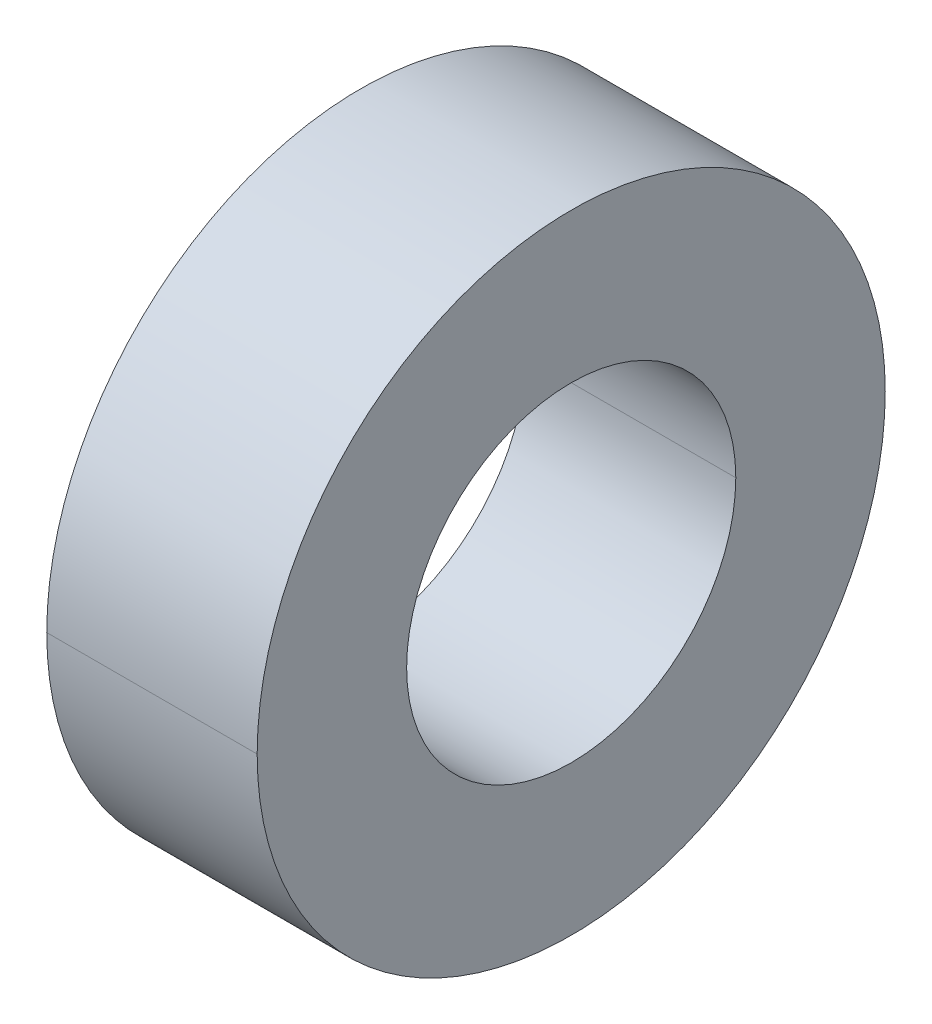
ISO-10303-21;
HEADER;
FILE_DESCRIPTION(('STEP AP214'),'2;1');
FILE_NAME('part.step','',(''),(''),'','','');
FILE_SCHEMA(('AUTOMOTIVE_DESIGN { 1 0 10303 214 1 1 1 1 }'));
ENDSEC;
DATA;
#1=APPLICATION_CONTEXT('core data for automotive mechanical design processes');
#2=APPLICATION_PROTOCOL_DEFINITION('international standard','automotive_design',2000,#1);
#3=PRODUCT_CONTEXT('',#1,'mechanical');
#4=PRODUCT('Part','Part','',(#3));
#5=PRODUCT_RELATED_PRODUCT_CATEGORY('part','',(#4));
#6=PRODUCT_DEFINITION_FORMATION('','',#4);
#7=PRODUCT_DEFINITION_CONTEXT('part definition',#1,'design');
#8=PRODUCT_DEFINITION('design','',#6,#7);
#9=PRODUCT_DEFINITION_SHAPE('','',#8);
#10=(LENGTH_UNIT() NAMED_UNIT(*) SI_UNIT(.MILLI.,.METRE.));
#11=(NAMED_UNIT(*) PLANE_ANGLE_UNIT() SI_UNIT($,.RADIAN.));
#12=(NAMED_UNIT(*) SI_UNIT($,.STERADIAN.) SOLID_ANGLE_UNIT());
#13=UNCERTAINTY_MEASURE_WITH_UNIT(LENGTH_MEASURE(1.E-05),#10,'distance_accuracy_value','');
#14=(GEOMETRIC_REPRESENTATION_CONTEXT(3) GLOBAL_UNCERTAINTY_ASSIGNED_CONTEXT((#13)) GLOBAL_UNIT_ASSIGNED_CONTEXT((#10,
#11,#12)) REPRESENTATION_CONTEXT('',''));
#15=CARTESIAN_POINT('',(0.,0.,0.));
#16=DIRECTION('',(0.,0.,1.));
#17=DIRECTION('',(1.,0.,0.));
#18=AXIS2_PLACEMENT_3D('',#15,#16,#17);
#19=CARTESIAN_POINT('',(1.59131,0.,0.));
#20=DIRECTION('',(-1.,0.,0.));
#21=DIRECTION('',(0.,0.,1.));
#22=AXIS2_PLACEMENT_3D('',#19,#20,#21);
#23=CYLINDRICAL_SURFACE('',#22,2.4892);
#24=DIRECTION('',(-1.,0.,0.));
#25=VECTOR('',#24,1.);
#26=CARTESIAN_POINT('',(1.59131,0.,-2.4892));
#27=LINE('',#26,#25);
#28=CARTESIAN_POINT('',(1.59131,0.,-2.4892));
#29=VERTEX_POINT('',#28);
#30=CARTESIAN_POINT('',(-1.59131,0.,-2.4892));
#31=VERTEX_POINT('',#30);
#32=EDGE_CURVE('E77',#29,#31,#27,.T.);
#33=ORIENTED_EDGE('',*,*,#32,.F.);
#34=CARTESIAN_POINT('',(1.59131,0.,0.));
#35=DIRECTION('',(1.,0.,0.));
#36=DIRECTION('',(0.,0.,-1.));
#37=AXIS2_PLACEMENT_3D('',#34,#35,#36);
#38=CIRCLE('',#37,2.4892);
#39=CARTESIAN_POINT('',(1.59131,0.,2.4892));
#40=VERTEX_POINT('',#39);
#41=EDGE_CURVE('E66',#29,#40,#38,.T.);
#42=ORIENTED_EDGE('',*,*,#41,.T.);
#43=DIRECTION('',(-1.,0.,0.));
#44=VECTOR('',#43,1.);
#45=CARTESIAN_POINT('',(1.59131,0.,2.4892));
#46=LINE('',#45,#44);
#47=CARTESIAN_POINT('',(-1.59131,0.,2.4892));
#48=VERTEX_POINT('',#47);
#49=EDGE_CURVE('E84',#40,#48,#46,.T.);
#50=ORIENTED_EDGE('',*,*,#49,.T.);
#51=CARTESIAN_POINT('',(-1.59131,0.,0.));
#52=DIRECTION('',(1.,0.,0.));
#53=DIRECTION('',(0.,0.,-1.));
#54=AXIS2_PLACEMENT_3D('',#51,#52,#53);
#55=CIRCLE('',#54,2.4892);
#56=EDGE_CURVE('E11',#31,#48,#55,.T.);
#57=ORIENTED_EDGE('',*,*,#56,.F.);
#58=EDGE_LOOP('',(#33,#42,#50,#57));
#59=FACE_BOUND('',#58,.T.);
#60=ADVANCED_FACE('F16',(#59),#23,.F.);
#61=CARTESIAN_POINT('',(1.59131,0.,0.));
#62=DIRECTION('',(-1.,0.,0.));
#63=DIRECTION('',(0.,0.,1.));
#64=AXIS2_PLACEMENT_3D('',#61,#62,#63);
#65=CYLINDRICAL_SURFACE('',#64,4.7498);
#66=DIRECTION('',(-1.,0.,0.));
#67=VECTOR('',#66,1.);
#68=CARTESIAN_POINT('',(1.59131,0.,-4.7498));
#69=LINE('',#68,#67);
#70=CARTESIAN_POINT('',(1.59131,0.,-4.7498));
#71=VERTEX_POINT('',#70);
#72=CARTESIAN_POINT('',(-1.59131,0.,-4.7498));
#73=VERTEX_POINT('',#72);
#74=EDGE_CURVE('E92',#71,#73,#69,.T.);
#75=ORIENTED_EDGE('',*,*,#74,.F.);
#76=CARTESIAN_POINT('',(1.59131,0.,0.));
#77=DIRECTION('',(1.,0.,0.));
#78=DIRECTION('',(0.,0.,-1.));
#79=AXIS2_PLACEMENT_3D('',#76,#77,#78);
#80=CIRCLE('',#79,4.7498);
#81=CARTESIAN_POINT('',(1.59131,0.,4.7498));
#82=VERTEX_POINT('',#81);
#83=EDGE_CURVE('E20',#82,#71,#80,.T.);
#84=ORIENTED_EDGE('',*,*,#83,.F.);
#85=DIRECTION('',(-1.,0.,0.));
#86=VECTOR('',#85,1.);
#87=CARTESIAN_POINT('',(1.59131,0.,4.7498));
#88=LINE('',#87,#86);
#89=CARTESIAN_POINT('',(-1.59131,0.,4.7498));
#90=VERTEX_POINT('',#89);
#91=EDGE_CURVE('E100',#82,#90,#88,.T.);
#92=ORIENTED_EDGE('',*,*,#91,.T.);
#93=CARTESIAN_POINT('',(-1.59131,0.,0.));
#94=DIRECTION('',(1.,0.,0.));
#95=DIRECTION('',(0.,0.,-1.));
#96=AXIS2_PLACEMENT_3D('',#93,#94,#95);
#97=CIRCLE('',#96,4.7498);
#98=EDGE_CURVE('E27',#90,#73,#97,.T.);
#99=ORIENTED_EDGE('',*,*,#98,.T.);
#100=EDGE_LOOP('',(#75,#84,#92,#99));
#101=FACE_BOUND('',#100,.T.);
#102=ADVANCED_FACE('F179',(#101),#65,.T.);
#103=CARTESIAN_POINT('',(-1.59131,0.,0.));
#104=DIRECTION('',(1.,0.,0.));
#105=DIRECTION('',(0.,1.,0.));
#106=AXIS2_PLACEMENT_3D('',#103,#104,#105);
#107=PLANE('',#106);
#108=CARTESIAN_POINT('',(-1.59131,0.,0.));
#109=DIRECTION('',(1.,0.,0.));
#110=DIRECTION('',(0.,0.,-1.));
#111=AXIS2_PLACEMENT_3D('',#108,#109,#110);
#112=CIRCLE('',#111,2.4892);
#113=EDGE_CURVE('E82',#48,#31,#112,.T.);
#114=ORIENTED_EDGE('',*,*,#113,.T.);
#115=ORIENTED_EDGE('',*,*,#56,.T.);
#116=EDGE_LOOP('',(#114,#115));
#117=FACE_BOUND('',#116,.T.);
#118=ORIENTED_EDGE('',*,*,#98,.F.);
#119=CARTESIAN_POINT('',(-1.59131,0.,0.));
#120=DIRECTION('',(1.,0.,0.));
#121=DIRECTION('',(0.,0.,-1.));
#122=AXIS2_PLACEMENT_3D('',#119,#120,#121);
#123=CIRCLE('',#122,4.7498);
#124=EDGE_CURVE('E102',#73,#90,#123,.T.);
#125=ORIENTED_EDGE('',*,*,#124,.F.);
#126=EDGE_LOOP('',(#118,#125));
#127=FACE_BOUND('',#126,.T.);
#128=ADVANCED_FACE('F175',(#117,#127),#107,.F.);
#129=CARTESIAN_POINT('',(1.59131,0.,0.));
#130=DIRECTION('',(1.,0.,0.));
#131=DIRECTION('',(0.,1.,0.));
#132=AXIS2_PLACEMENT_3D('',#129,#130,#131);
#133=PLANE('',#132);
#134=CARTESIAN_POINT('',(1.59131,0.,0.));
#135=DIRECTION('',(1.,0.,0.));
#136=DIRECTION('',(0.,0.,-1.));
#137=AXIS2_PLACEMENT_3D('',#134,#135,#136);
#138=CIRCLE('',#137,2.4892);
#139=EDGE_CURVE('E71',#40,#29,#138,.T.);
#140=ORIENTED_EDGE('',*,*,#139,.F.);
#141=ORIENTED_EDGE('',*,*,#41,.F.);
#142=EDGE_LOOP('',(#140,#141));
#143=FACE_BOUND('',#142,.T.);
#144=ORIENTED_EDGE('',*,*,#83,.T.);
#145=CARTESIAN_POINT('',(1.59131,0.,0.));
#146=DIRECTION('',(1.,0.,0.));
#147=DIRECTION('',(0.,0.,-1.));
#148=AXIS2_PLACEMENT_3D('',#145,#146,#147);
#149=CIRCLE('',#148,4.7498);
#150=EDGE_CURVE('E96',#71,#82,#149,.T.);
#151=ORIENTED_EDGE('',*,*,#150,.T.);
#152=EDGE_LOOP('',(#144,#151));
#153=FACE_BOUND('',#152,.T.);
#154=ADVANCED_FACE('F68',(#143,#153),#133,.T.);
#155=CARTESIAN_POINT('',(1.59131,0.,0.));
#156=DIRECTION('',(-1.,0.,0.));
#157=DIRECTION('',(0.,0.,1.));
#158=AXIS2_PLACEMENT_3D('',#155,#156,#157);
#159=CYLINDRICAL_SURFACE('',#158,4.7498);
#160=ORIENTED_EDGE('',*,*,#150,.F.);
#161=ORIENTED_EDGE('',*,*,#74,.T.);
#162=ORIENTED_EDGE('',*,*,#124,.T.);
#163=ORIENTED_EDGE('',*,*,#91,.F.);
#164=EDGE_LOOP('',(#160,#161,#162,#163));
#165=FACE_BOUND('',#164,.T.);
#166=ADVANCED_FACE('F191',(#165),#159,.T.);
#167=CARTESIAN_POINT('',(1.59131,0.,0.));
#168=DIRECTION('',(-1.,0.,0.));
#169=DIRECTION('',(0.,0.,1.));
#170=AXIS2_PLACEMENT_3D('',#167,#168,#169);
#171=CYLINDRICAL_SURFACE('',#170,2.4892);
#172=ORIENTED_EDGE('',*,*,#139,.T.);
#173=ORIENTED_EDGE('',*,*,#32,.T.);
#174=ORIENTED_EDGE('',*,*,#113,.F.);
#175=ORIENTED_EDGE('',*,*,#49,.F.);
#176=EDGE_LOOP('',(#172,#173,#174,#175));
#177=FACE_BOUND('',#176,.T.);
#178=ADVANCED_FACE('F18',(#177),#171,.F.);
#179=CLOSED_SHELL('',(#60,#102,#128,#154,#166,#178));
#180=MANIFOLD_SOLID_BREP('B1',#179);
#181=ADVANCED_BREP_SHAPE_REPRESENTATION('',(#18,#180),#14);
#182=SHAPE_DEFINITION_REPRESENTATION(#9,#181);
ENDSEC;
END-ISO-10303-21;
